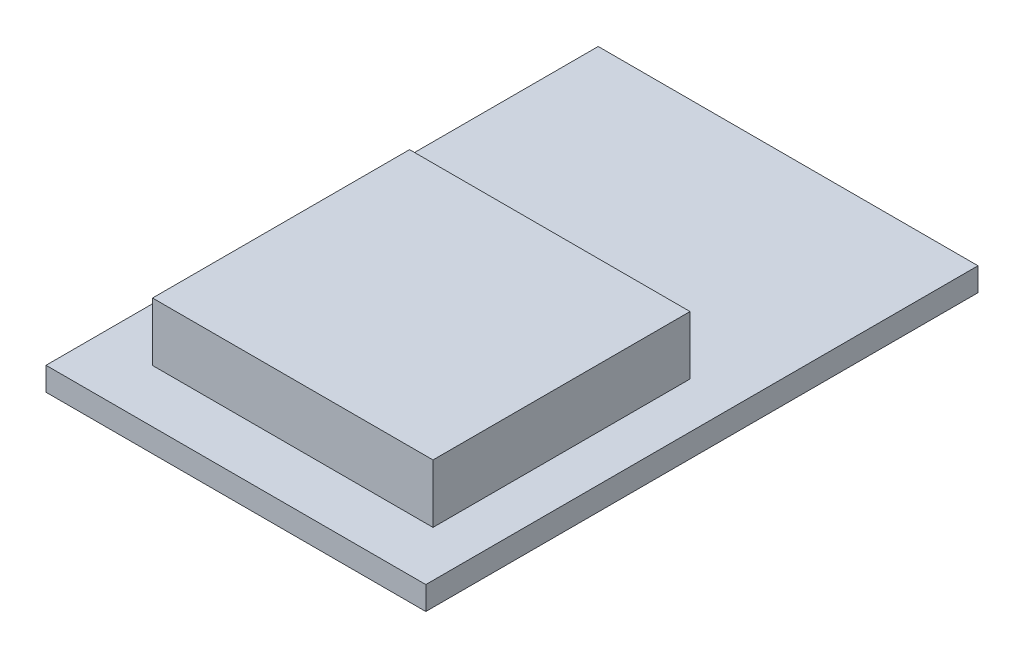
ISO-10303-21;
HEADER;
FILE_DESCRIPTION(('STEP AP214'),'2;1');
FILE_NAME('part.step','',(''),(''),'','','');
FILE_SCHEMA(('AUTOMOTIVE_DESIGN { 1 0 10303 214 1 1 1 1 }'));
ENDSEC;
DATA;
#1=APPLICATION_CONTEXT('core data for automotive mechanical design processes');
#2=APPLICATION_PROTOCOL_DEFINITION('international standard','automotive_design',2000,#1);
#3=PRODUCT_CONTEXT('',#1,'mechanical');
#4=PRODUCT('Part','Part','',(#3));
#5=PRODUCT_RELATED_PRODUCT_CATEGORY('part','',(#4));
#6=PRODUCT_DEFINITION_FORMATION('','',#4);
#7=PRODUCT_DEFINITION_CONTEXT('part definition',#1,'design');
#8=PRODUCT_DEFINITION('design','',#6,#7);
#9=PRODUCT_DEFINITION_SHAPE('','',#8);
#10=(LENGTH_UNIT() NAMED_UNIT(*) SI_UNIT(.MILLI.,.METRE.));
#11=(NAMED_UNIT(*) PLANE_ANGLE_UNIT() SI_UNIT($,.RADIAN.));
#12=(NAMED_UNIT(*) SI_UNIT($,.STERADIAN.) SOLID_ANGLE_UNIT());
#13=UNCERTAINTY_MEASURE_WITH_UNIT(LENGTH_MEASURE(1.E-05),#10,'distance_accuracy_value','');
#14=(GEOMETRIC_REPRESENTATION_CONTEXT(3) GLOBAL_UNCERTAINTY_ASSIGNED_CONTEXT((#13)) GLOBAL_UNIT_ASSIGNED_CONTEXT((#10,
#11,#12)) REPRESENTATION_CONTEXT('',''));
#15=CARTESIAN_POINT('',(0.,0.,0.));
#16=DIRECTION('',(0.,0.,1.));
#17=DIRECTION('',(1.,0.,0.));
#18=AXIS2_PLACEMENT_3D('',#15,#16,#17);
#19=CARTESIAN_POINT('',(0.,0.8,0.));
#20=DIRECTION('',(0.,-1.,0.));
#21=DIRECTION('',(0.,0.,-1.));
#22=AXIS2_PLACEMENT_3D('',#19,#20,#21);
#23=PLANE('',#22);
#24=DIRECTION('',(0.,0.,1.));
#25=VECTOR('',#24,1.);
#26=CARTESIAN_POINT('',(0.,0.8,0.));
#27=LINE('',#26,#25);
#28=CARTESIAN_POINT('',(0.,0.8,-18.9));
#29=VERTEX_POINT('',#28);
#30=CARTESIAN_POINT('',(0.,0.8,0.));
#31=VERTEX_POINT('',#30);
#32=EDGE_CURVE('E130',#29,#31,#27,.T.);
#33=ORIENTED_EDGE('',*,*,#32,.T.);
#34=DIRECTION('',(1.,0.,0.));
#35=VECTOR('',#34,1.);
#36=CARTESIAN_POINT('',(0.,0.8,0.));
#37=LINE('',#36,#35);
#38=CARTESIAN_POINT('',(13.,0.8,0.));
#39=VERTEX_POINT('',#38);
#40=EDGE_CURVE('E133',#31,#39,#37,.T.);
#41=ORIENTED_EDGE('',*,*,#40,.T.);
#42=DIRECTION('',(0.,0.,-1.));
#43=VECTOR('',#42,1.);
#44=CARTESIAN_POINT('',(13.,0.8,0.));
#45=LINE('',#44,#43);
#46=CARTESIAN_POINT('',(13.,0.8,-18.9));
#47=VERTEX_POINT('',#46);
#48=EDGE_CURVE('E136',#39,#47,#45,.T.);
#49=ORIENTED_EDGE('',*,*,#48,.T.);
#50=DIRECTION('',(-1.,0.,0.));
#51=VECTOR('',#50,1.);
#52=CARTESIAN_POINT('',(0.,0.8,-18.9));
#53=LINE('',#52,#51);
#54=EDGE_CURVE('E138',#47,#29,#53,.T.);
#55=ORIENTED_EDGE('',*,*,#54,.T.);
#56=EDGE_LOOP('',(#33,#41,#49,#55));
#57=FACE_BOUND('',#56,.T.);
#58=DIRECTION('',(0.,0.,1.));
#59=VECTOR('',#58,1.);
#60=CARTESIAN_POINT('',(1.82965838509317,0.8,-10.6143510951291));
#61=LINE('',#60,#59);
#62=CARTESIAN_POINT('',(1.82965838509317,0.8,-10.6143510951291));
#63=VERTEX_POINT('',#62);
#64=CARTESIAN_POINT('',(1.82965838509317,0.8,-1.81703170970906));
#65=VERTEX_POINT('',#64);
#66=EDGE_CURVE('E120',#63,#65,#61,.T.);
#67=ORIENTED_EDGE('',*,*,#66,.F.);
#68=DIRECTION('',(-1.,0.,0.));
#69=VECTOR('',#68,1.);
#70=CARTESIAN_POINT('',(1.82965838509317,0.8,-10.6143510951291));
#71=LINE('',#70,#69);
#72=CARTESIAN_POINT('',(11.4290863027133,0.8,-10.6143510951291));
#73=VERTEX_POINT('',#72);
#74=EDGE_CURVE('E117',#73,#63,#71,.T.);
#75=ORIENTED_EDGE('',*,*,#74,.F.);
#76=DIRECTION('',(0.,0.,-1.));
#77=VECTOR('',#76,1.);
#78=CARTESIAN_POINT('',(11.4290863027133,0.8,-10.6143510951291));
#79=LINE('',#78,#77);
#80=CARTESIAN_POINT('',(11.4290863027133,0.8,-1.81703170970906));
#81=VERTEX_POINT('',#80);
#82=EDGE_CURVE('E55',#81,#73,#79,.T.);
#83=ORIENTED_EDGE('',*,*,#82,.F.);
#84=DIRECTION('',(1.,0.,0.));
#85=VECTOR('',#84,1.);
#86=CARTESIAN_POINT('',(1.82965838509317,0.8,-1.81703170970906));
#87=LINE('',#86,#85);
#88=EDGE_CURVE('E50',#65,#81,#87,.T.);
#89=ORIENTED_EDGE('',*,*,#88,.F.);
#90=EDGE_LOOP('',(#67,#75,#83,#89));
#91=FACE_BOUND('',#90,.T.);
#92=ADVANCED_FACE('F35',(#57,#91),#23,.F.);
#93=CARTESIAN_POINT('',(0.,0.8,0.));
#94=DIRECTION('',(1.,0.,0.));
#95=DIRECTION('',(0.,0.,-1.));
#96=AXIS2_PLACEMENT_3D('',#93,#94,#95);
#97=PLANE('',#96);
#98=DIRECTION('',(0.,0.,1.));
#99=VECTOR('',#98,1.);
#100=CARTESIAN_POINT('',(0.,0.,0.));
#101=LINE('',#100,#99);
#102=CARTESIAN_POINT('',(0.,0.,-18.9));
#103=VERTEX_POINT('',#102);
#104=CARTESIAN_POINT('',(0.,0.,0.));
#105=VERTEX_POINT('',#104);
#106=EDGE_CURVE('E121',#103,#105,#101,.T.);
#107=ORIENTED_EDGE('',*,*,#106,.T.);
#108=DIRECTION('',(0.,-1.,0.));
#109=VECTOR('',#108,1.);
#110=CARTESIAN_POINT('',(0.,0.8,0.));
#111=LINE('',#110,#109);
#112=EDGE_CURVE('E11',#31,#105,#111,.T.);
#113=ORIENTED_EDGE('',*,*,#112,.F.);
#114=ORIENTED_EDGE('',*,*,#32,.F.);
#115=DIRECTION('',(0.,-1.,0.));
#116=VECTOR('',#115,1.);
#117=CARTESIAN_POINT('',(0.,0.8,-18.9));
#118=LINE('',#117,#116);
#119=EDGE_CURVE('E139',#29,#103,#118,.T.);
#120=ORIENTED_EDGE('',*,*,#119,.T.);
#121=EDGE_LOOP('',(#107,#113,#114,#120));
#122=FACE_BOUND('',#121,.T.);
#123=ADVANCED_FACE('F37',(#122),#97,.F.);
#124=CARTESIAN_POINT('',(0.,0.8,0.));
#125=DIRECTION('',(0.,0.,-1.));
#126=DIRECTION('',(-1.,0.,0.));
#127=AXIS2_PLACEMENT_3D('',#124,#125,#126);
#128=PLANE('',#127);
#129=DIRECTION('',(1.,0.,0.));
#130=VECTOR('',#129,1.);
#131=CARTESIAN_POINT('',(0.,0.,0.));
#132=LINE('',#131,#130);
#133=CARTESIAN_POINT('',(13.,0.,0.));
#134=VERTEX_POINT('',#133);
#135=EDGE_CURVE('E124',#105,#134,#132,.T.);
#136=ORIENTED_EDGE('',*,*,#135,.T.);
#137=DIRECTION('',(0.,-1.,0.));
#138=VECTOR('',#137,1.);
#139=CARTESIAN_POINT('',(13.,0.8,0.));
#140=LINE('',#139,#138);
#141=EDGE_CURVE('E43',#39,#134,#140,.T.);
#142=ORIENTED_EDGE('',*,*,#141,.F.);
#143=ORIENTED_EDGE('',*,*,#40,.F.);
#144=ORIENTED_EDGE('',*,*,#112,.T.);
#145=EDGE_LOOP('',(#136,#142,#143,#144));
#146=FACE_BOUND('',#145,.T.);
#147=ADVANCED_FACE('F169',(#146),#128,.F.);
#148=CARTESIAN_POINT('',(13.,0.8,0.));
#149=DIRECTION('',(-1.,0.,0.));
#150=DIRECTION('',(0.,0.,1.));
#151=AXIS2_PLACEMENT_3D('',#148,#149,#150);
#152=PLANE('',#151);
#153=DIRECTION('',(0.,0.,-1.));
#154=VECTOR('',#153,1.);
#155=CARTESIAN_POINT('',(13.,0.,0.));
#156=LINE('',#155,#154);
#157=CARTESIAN_POINT('',(13.,0.,-18.9));
#158=VERTEX_POINT('',#157);
#159=EDGE_CURVE('E142',#134,#158,#156,.T.);
#160=ORIENTED_EDGE('',*,*,#159,.T.);
#161=DIRECTION('',(0.,-1.,0.));
#162=VECTOR('',#161,1.);
#163=CARTESIAN_POINT('',(13.,0.8,-18.9));
#164=LINE('',#163,#162);
#165=EDGE_CURVE('E147',#47,#158,#164,.T.);
#166=ORIENTED_EDGE('',*,*,#165,.F.);
#167=ORIENTED_EDGE('',*,*,#48,.F.);
#168=ORIENTED_EDGE('',*,*,#141,.T.);
#169=EDGE_LOOP('',(#160,#166,#167,#168));
#170=FACE_BOUND('',#169,.T.);
#171=ADVANCED_FACE('F154',(#170),#152,.F.);
#172=CARTESIAN_POINT('',(0.,0.8,-18.9));
#173=DIRECTION('',(0.,0.,1.));
#174=DIRECTION('',(1.,0.,0.));
#175=AXIS2_PLACEMENT_3D('',#172,#173,#174);
#176=PLANE('',#175);
#177=DIRECTION('',(-1.,0.,0.));
#178=VECTOR('',#177,1.);
#179=CARTESIAN_POINT('',(0.,0.,-18.9));
#180=LINE('',#179,#178);
#181=EDGE_CURVE('E134',#158,#103,#180,.T.);
#182=ORIENTED_EDGE('',*,*,#181,.T.);
#183=ORIENTED_EDGE('',*,*,#119,.F.);
#184=ORIENTED_EDGE('',*,*,#54,.F.);
#185=ORIENTED_EDGE('',*,*,#165,.T.);
#186=EDGE_LOOP('',(#182,#183,#184,#185));
#187=FACE_BOUND('',#186,.T.);
#188=ADVANCED_FACE('F163',(#187),#176,.F.);
#189=CARTESIAN_POINT('',(0.,0.,0.));
#190=DIRECTION('',(0.,-1.,0.));
#191=DIRECTION('',(0.,0.,-1.));
#192=AXIS2_PLACEMENT_3D('',#189,#190,#191);
#193=PLANE('',#192);
#194=ORIENTED_EDGE('',*,*,#106,.F.);
#195=ORIENTED_EDGE('',*,*,#181,.F.);
#196=ORIENTED_EDGE('',*,*,#159,.F.);
#197=ORIENTED_EDGE('',*,*,#135,.F.);
#198=EDGE_LOOP('',(#194,#195,#196,#197));
#199=FACE_BOUND('',#198,.T.);
#200=ADVANCED_FACE('F160',(#199),#193,.T.);
#201=CARTESIAN_POINT('',(1.82965838509317,2.8,-10.6143510951291));
#202=DIRECTION('',(1.,0.,0.));
#203=DIRECTION('',(0.,0.,-1.));
#204=AXIS2_PLACEMENT_3D('',#201,#202,#203);
#205=PLANE('',#204);
#206=ORIENTED_EDGE('',*,*,#66,.T.);
#207=DIRECTION('',(0.,-1.,0.));
#208=VECTOR('',#207,1.);
#209=CARTESIAN_POINT('',(1.82965838509317,2.8,-1.81703170970906));
#210=LINE('',#209,#208);
#211=CARTESIAN_POINT('',(1.82965838509317,2.8,-1.81703170970906));
#212=VERTEX_POINT('',#211);
#213=EDGE_CURVE('E101',#212,#65,#210,.T.);
#214=ORIENTED_EDGE('',*,*,#213,.F.);
#215=DIRECTION('',(0.,0.,1.));
#216=VECTOR('',#215,1.);
#217=CARTESIAN_POINT('',(1.82965838509317,2.8,-10.6143510951291));
#218=LINE('',#217,#216);
#219=CARTESIAN_POINT('',(1.82965838509317,2.8,-10.6143510951291));
#220=VERTEX_POINT('',#219);
#221=EDGE_CURVE('E108',#220,#212,#218,.T.);
#222=ORIENTED_EDGE('',*,*,#221,.F.);
#223=DIRECTION('',(0.,-1.,0.));
#224=VECTOR('',#223,1.);
#225=CARTESIAN_POINT('',(1.82965838509317,2.8,-10.6143510951291));
#226=LINE('',#225,#224);
#227=EDGE_CURVE('E272',#220,#63,#226,.T.);
#228=ORIENTED_EDGE('',*,*,#227,.T.);
#229=EDGE_LOOP('',(#206,#214,#222,#228));
#230=FACE_BOUND('',#229,.T.);
#231=ADVANCED_FACE('F119',(#230),#205,.F.);
#232=CARTESIAN_POINT('',(1.82965838509317,2.8,-1.81703170970906));
#233=DIRECTION('',(0.,0.,-1.));
#234=DIRECTION('',(-1.,0.,0.));
#235=AXIS2_PLACEMENT_3D('',#232,#233,#234);
#236=PLANE('',#235);
#237=ORIENTED_EDGE('',*,*,#88,.T.);
#238=DIRECTION('',(0.,-1.,0.));
#239=VECTOR('',#238,1.);
#240=CARTESIAN_POINT('',(11.4290863027133,2.8,-1.81703170970906));
#241=LINE('',#240,#239);
#242=CARTESIAN_POINT('',(11.4290863027133,2.8,-1.81703170970906));
#243=VERTEX_POINT('',#242);
#244=EDGE_CURVE('E104',#243,#81,#241,.T.);
#245=ORIENTED_EDGE('',*,*,#244,.F.);
#246=DIRECTION('',(1.,0.,0.));
#247=VECTOR('',#246,1.);
#248=CARTESIAN_POINT('',(1.82965838509317,2.8,-1.81703170970906));
#249=LINE('',#248,#247);
#250=EDGE_CURVE('E97',#212,#243,#249,.T.);
#251=ORIENTED_EDGE('',*,*,#250,.F.);
#252=ORIENTED_EDGE('',*,*,#213,.T.);
#253=EDGE_LOOP('',(#237,#245,#251,#252));
#254=FACE_BOUND('',#253,.T.);
#255=ADVANCED_FACE('F99',(#254),#236,.F.);
#256=CARTESIAN_POINT('',(11.4290863027133,2.8,-10.6143510951291));
#257=DIRECTION('',(-1.,0.,0.));
#258=DIRECTION('',(0.,0.,1.));
#259=AXIS2_PLACEMENT_3D('',#256,#257,#258);
#260=PLANE('',#259);
#261=ORIENTED_EDGE('',*,*,#82,.T.);
#262=DIRECTION('',(0.,-1.,0.));
#263=VECTOR('',#262,1.);
#264=CARTESIAN_POINT('',(11.4290863027133,2.8,-10.6143510951291));
#265=LINE('',#264,#263);
#266=CARTESIAN_POINT('',(11.4290863027133,2.8,-10.6143510951291));
#267=VERTEX_POINT('',#266);
#268=EDGE_CURVE('E126',#267,#73,#265,.T.);
#269=ORIENTED_EDGE('',*,*,#268,.F.);
#270=DIRECTION('',(0.,0.,-1.));
#271=VECTOR('',#270,1.);
#272=CARTESIAN_POINT('',(11.4290863027133,2.8,-10.6143510951291));
#273=LINE('',#272,#271);
#274=EDGE_CURVE('E107',#243,#267,#273,.T.);
#275=ORIENTED_EDGE('',*,*,#274,.F.);
#276=ORIENTED_EDGE('',*,*,#244,.T.);
#277=EDGE_LOOP('',(#261,#269,#275,#276));
#278=FACE_BOUND('',#277,.T.);
#279=ADVANCED_FACE('F206',(#278),#260,.F.);
#280=CARTESIAN_POINT('',(1.82965838509317,2.8,-10.6143510951291));
#281=DIRECTION('',(0.,0.,1.));
#282=DIRECTION('',(1.,0.,0.));
#283=AXIS2_PLACEMENT_3D('',#280,#281,#282);
#284=PLANE('',#283);
#285=ORIENTED_EDGE('',*,*,#74,.T.);
#286=ORIENTED_EDGE('',*,*,#227,.F.);
#287=DIRECTION('',(-1.,0.,0.));
#288=VECTOR('',#287,1.);
#289=CARTESIAN_POINT('',(1.82965838509317,2.8,-10.6143510951291));
#290=LINE('',#289,#288);
#291=EDGE_CURVE('E113',#267,#220,#290,.T.);
#292=ORIENTED_EDGE('',*,*,#291,.F.);
#293=ORIENTED_EDGE('',*,*,#268,.T.);
#294=EDGE_LOOP('',(#285,#286,#292,#293));
#295=FACE_BOUND('',#294,.T.);
#296=ADVANCED_FACE('F212',(#295),#284,.F.);
#297=CARTESIAN_POINT('',(0.,2.8,0.));
#298=DIRECTION('',(0.,1.,0.));
#299=DIRECTION('',(0.,0.,1.));
#300=AXIS2_PLACEMENT_3D('',#297,#298,#299);
#301=PLANE('',#300);
#302=ORIENTED_EDGE('',*,*,#221,.T.);
#303=ORIENTED_EDGE('',*,*,#250,.T.);
#304=ORIENTED_EDGE('',*,*,#274,.T.);
#305=ORIENTED_EDGE('',*,*,#291,.T.);
#306=EDGE_LOOP('',(#302,#303,#304,#305));
#307=FACE_BOUND('',#306,.T.);
#308=ADVANCED_FACE('F111',(#307),#301,.T.);
#309=CLOSED_SHELL('',(#92,#123,#147,#171,#188,#200,#231,#255,#279,#296,#308));
#310=MANIFOLD_SOLID_BREP('B2',#309);
#311=ADVANCED_BREP_SHAPE_REPRESENTATION('',(#18,#310),#14);
#312=SHAPE_DEFINITION_REPRESENTATION(#9,#311);
ENDSEC;
END-ISO-10303-21;
